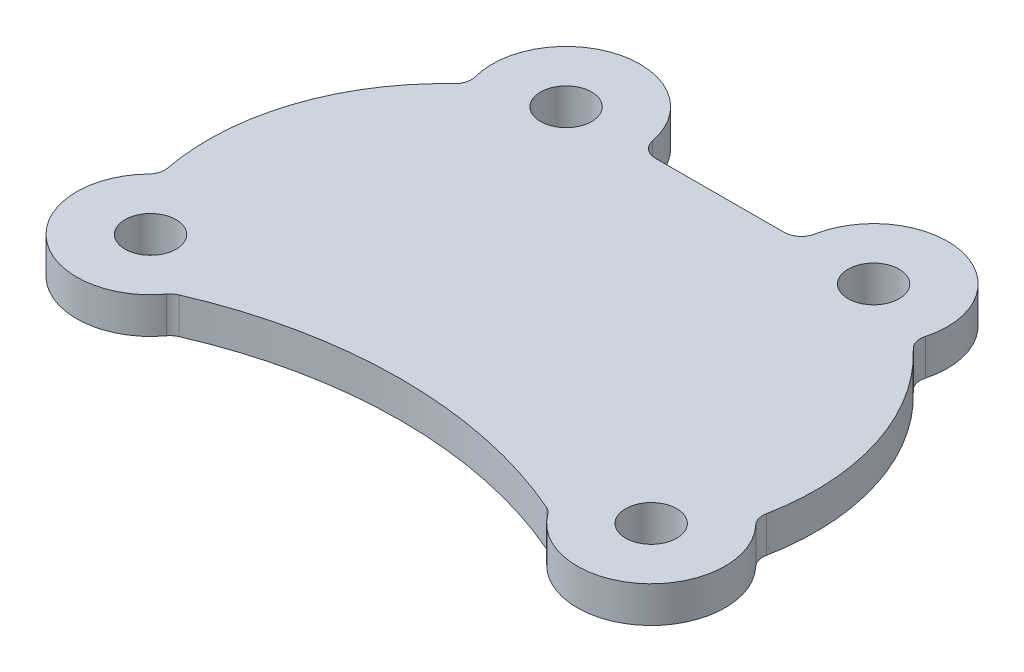
ISO-10303-21;
HEADER;
FILE_DESCRIPTION(('STEP AP214'),'2;1');
FILE_NAME('part.step','',(''),(''),'','','');
FILE_SCHEMA(('AUTOMOTIVE_DESIGN { 1 0 10303 214 1 1 1 1 }'));
ENDSEC;
DATA;
#1=APPLICATION_CONTEXT('core data for automotive mechanical design processes');
#2=APPLICATION_PROTOCOL_DEFINITION('international standard','automotive_design',2000,#1);
#3=PRODUCT_CONTEXT('',#1,'mechanical');
#4=PRODUCT('Part','Part','',(#3));
#5=PRODUCT_RELATED_PRODUCT_CATEGORY('part','',(#4));
#6=PRODUCT_DEFINITION_FORMATION('','',#4);
#7=PRODUCT_DEFINITION_CONTEXT('part definition',#1,'design');
#8=PRODUCT_DEFINITION('design','',#6,#7);
#9=PRODUCT_DEFINITION_SHAPE('','',#8);
#10=(LENGTH_UNIT() NAMED_UNIT(*) SI_UNIT(.MILLI.,.METRE.));
#11=(NAMED_UNIT(*) PLANE_ANGLE_UNIT() SI_UNIT($,.RADIAN.));
#12=(NAMED_UNIT(*) SI_UNIT($,.STERADIAN.) SOLID_ANGLE_UNIT());
#13=UNCERTAINTY_MEASURE_WITH_UNIT(LENGTH_MEASURE(1.E-05),#10,'distance_accuracy_value','');
#14=(GEOMETRIC_REPRESENTATION_CONTEXT(3) GLOBAL_UNCERTAINTY_ASSIGNED_CONTEXT((#13)) GLOBAL_UNIT_ASSIGNED_CONTEXT((#10,
#11,#12)) REPRESENTATION_CONTEXT('',''));
#15=CARTESIAN_POINT('',(0.,0.,0.));
#16=DIRECTION('',(0.,0.,1.));
#17=DIRECTION('',(1.,0.,0.));
#18=AXIS2_PLACEMENT_3D('',#15,#16,#17);
#19=CARTESIAN_POINT('',(32.8061466226183,6.35,-58.9531036052104));
#20=DIRECTION('',(0.,-1.,0.));
#21=DIRECTION('',(0.,0.,-1.));
#22=AXIS2_PLACEMENT_3D('',#19,#20,#21);
#23=PLANE('',#22);
#24=CARTESIAN_POINT('',(0.,6.35,0.));
#25=DIRECTION('',(0.,1.,0.));
#26=DIRECTION('',(0.,0.,1.));
#27=AXIS2_PLACEMENT_3D('',#24,#25,#26);
#28=CIRCLE('',#27,4.5);
#29=CARTESIAN_POINT('',(0.,6.35,4.5));
#30=VERTEX_POINT('',#29);
#31=EDGE_CURVE('E374',#30,#30,#28,.T.);
#32=ORIENTED_EDGE('',*,*,#31,.F.);
#33=EDGE_LOOP('',(#32));
#34=FACE_BOUND('',#33,.T.);
#35=CARTESIAN_POINT('',(17.0909373326016,6.35,-55.9477422340981));
#36=DIRECTION('',(0.,1.,0.));
#37=DIRECTION('',(0.,0.,1.));
#38=AXIS2_PLACEMENT_3D('',#35,#36,#37);
#39=CIRCLE('',#38,4.5);
#40=CARTESIAN_POINT('',(17.0909373326016,6.35,-51.4477422340981));
#41=VERTEX_POINT('',#40);
#42=EDGE_CURVE('E160',#41,#41,#39,.T.);
#43=ORIENTED_EDGE('',*,*,#42,.F.);
#44=EDGE_LOOP('',(#43));
#45=FACE_BOUND('',#44,.T.);
#46=CARTESIAN_POINT('',(32.8061466226183,6.35,-58.9531036052104));
#47=DIRECTION('',(0.,-1.,0.));
#48=DIRECTION('',(0.,0.,-1.));
#49=AXIS2_PLACEMENT_3D('',#46,#47,#48);
#50=CIRCLE('',#49,3.);
#51=CARTESIAN_POINT('',(32.8120638736978,6.35,-55.9531094408595));
#52=VERTEX_POINT('',#51);
#53=CARTESIAN_POINT('',(29.8595448807401,6.35,-58.3895983481269));
#54=VERTEX_POINT('',#53);
#55=EDGE_CURVE('E194',#52,#54,#50,.T.);
#56=ORIENTED_EDGE('',*,*,#55,.T.);
#57=CARTESIAN_POINT('',(17.0909373326016,6.35,-55.9477422340981));
#58=DIRECTION('',(0.,1.,0.));
#59=DIRECTION('',(0.,0.,1.));
#60=AXIS2_PLACEMENT_3D('',#57,#58,#59);
#61=CIRCLE('',#60,13.);
#62=CARTESIAN_POINT('',(4.54245769860197,6.35,-52.5513236975958));
#63=VERTEX_POINT('',#62);
#64=EDGE_CURVE('E155',#54,#63,#61,.T.);
#65=ORIENTED_EDGE('',*,*,#64,.T.);
#66=CARTESIAN_POINT('',(1.64665470614052,6.35,-51.7675348045568));
#67=DIRECTION('',(0.,-1.,0.));
#68=DIRECTION('',(0.,0.,1.));
#69=AXIS2_PLACEMENT_3D('',#66,#67,#68);
#70=CIRCLE('',#69,3.);
#71=CARTESIAN_POINT('',(3.70044759841328,6.35,-49.5807712700954));
#72=VERTEX_POINT('',#71);
#73=EDGE_CURVE('E197',#63,#72,#70,.T.);
#74=ORIENTED_EDGE('',*,*,#73,.T.);
#75=CARTESIAN_POINT('',(32.0193397833499,6.35,-19.4284024507483));
#76=DIRECTION('',(0.,1.,0.));
#77=DIRECTION('',(0.,0.,1.));
#78=AXIS2_PLACEMENT_3D('',#75,#76,#77);
#79=CIRCLE('',#78,41.3657466994131);
#80=CARTESIAN_POINT('',(-8.60571551005477,6.35,-11.6354644676884));
#81=VERTEX_POINT('',#80);
#82=EDGE_CURVE('E199',#72,#81,#79,.T.);
#83=ORIENTED_EDGE('',*,*,#82,.T.);
#84=CARTESIAN_POINT('',(-11.551997775085,6.35,-11.0702912068487));
#85=DIRECTION('',(0.,-1.,0.));
#86=DIRECTION('',(0.,0.,1.));
#87=AXIS2_PLACEMENT_3D('',#84,#85,#86);
#88=CIRCLE('',#87,3.);
#89=CARTESIAN_POINT('',(-9.38599819225658,6.35,-8.99461160556453));
#90=VERTEX_POINT('',#89);
#91=EDGE_CURVE('E201',#81,#90,#88,.T.);
#92=ORIENTED_EDGE('',*,*,#91,.T.);
#93=CARTESIAN_POINT('',(0.,6.35,0.));
#94=DIRECTION('',(0.,1.,0.));
#95=DIRECTION('',(0.,0.,1.));
#96=AXIS2_PLACEMENT_3D('',#93,#94,#95);
#97=CIRCLE('',#96,13.);
#98=CARTESIAN_POINT('',(10.4755168613593,6.35,7.69828204779337));
#99=VERTEX_POINT('',#98);
#100=EDGE_CURVE('E203',#90,#99,#97,.T.);
#101=ORIENTED_EDGE('',*,*,#100,.T.);
#102=CARTESIAN_POINT('',(12.8929438293653,6.35,9.47480867420723));
#103=DIRECTION('',(0.,-1.,0.));
#104=DIRECTION('',(0.,0.,1.));
#105=AXIS2_PLACEMENT_3D('',#102,#103,#104);
#106=CIRCLE('',#105,3.);
#107=CARTESIAN_POINT('',(11.6959283477128,6.35,6.72396263404351));
#108=VERTEX_POINT('',#107);
#109=EDGE_CURVE('E205',#99,#108,#106,.T.);
#110=ORIENTED_EDGE('',*,*,#109,.T.);
#111=CARTESIAN_POINT('',(44.,6.35,80.9615384615385));
#112=DIRECTION('',(0.,-1.,0.));
#113=DIRECTION('',(0.,0.,-1.));
#114=AXIS2_PLACEMENT_3D('',#111,#112,#113);
#115=CIRCLE('',#114,80.9615384615385);
#116=CARTESIAN_POINT('',(76.3040716522872,6.35,6.72396263404349));
#117=VERTEX_POINT('',#116);
#118=EDGE_CURVE('E207',#108,#117,#115,.T.);
#119=ORIENTED_EDGE('',*,*,#118,.T.);
#120=CARTESIAN_POINT('',(75.1070561706347,6.35,9.4748086742072));
#121=DIRECTION('',(0.,-1.,0.));
#122=DIRECTION('',(0.,0.,1.));
#123=AXIS2_PLACEMENT_3D('',#120,#121,#122);
#124=CIRCLE('',#123,3.);
#125=CARTESIAN_POINT('',(77.5244831386407,6.35,7.69828204779334));
#126=VERTEX_POINT('',#125);
#127=EDGE_CURVE('E209',#117,#126,#124,.T.);
#128=ORIENTED_EDGE('',*,*,#127,.T.);
#129=CARTESIAN_POINT('',(88.,6.35,0.));
#130=DIRECTION('',(0.,1.,0.));
#131=DIRECTION('',(0.,0.,1.));
#132=AXIS2_PLACEMENT_3D('',#129,#130,#131);
#133=CIRCLE('',#132,13.);
#134=CARTESIAN_POINT('',(97.4132599535078,6.35,-8.96607701548936));
#135=VERTEX_POINT('',#134);
#136=EDGE_CURVE('E211',#126,#135,#133,.T.);
#137=ORIENTED_EDGE('',*,*,#136,.T.);
#138=CARTESIAN_POINT('',(99.5855507120096,6.35,-11.0351717113715));
#139=DIRECTION('',(0.,-1.,0.));
#140=DIRECTION('',(0.,0.,1.));
#141=AXIS2_PLACEMENT_3D('',#138,#139,#140);
#142=CIRCLE('',#141,3.);
#143=CARTESIAN_POINT('',(96.641280567555,6.35,-11.610735188734));
#144=VERTEX_POINT('',#143);
#145=EDGE_CURVE('E213',#135,#144,#142,.T.);
#146=ORIENTED_EDGE('',*,*,#145,.T.);
#147=CARTESIAN_POINT('',(56.0439695641714,6.35,-19.5469395267377));
#148=DIRECTION('',(0.,1.,0.));
#149=DIRECTION('',(0.,0.,-1.));
#150=AXIS2_PLACEMENT_3D('',#147,#148,#149);
#151=CIRCLE('',#150,41.365746699413);
#152=CARTESIAN_POINT('',(84.4636142605688,6.35,-49.6043644884761));
#153=VERTEX_POINT('',#152);
#154=EDGE_CURVE('E215',#144,#153,#151,.T.);
#155=ORIENTED_EDGE('',*,*,#154,.T.);
#156=CARTESIAN_POINT('',(86.5247141050544,6.35,-51.7842423362146));
#157=DIRECTION('',(0.,-1.,0.));
#158=DIRECTION('',(0.,0.,1.));
#159=AXIS2_PLACEMENT_3D('',#156,#157,#158);
#160=CIRCLE('',#159,3.);
#161=CARTESIAN_POINT('',(83.6308756649022,6.35,-52.5752537661555));
#162=VERTEX_POINT('',#161);
#163=EDGE_CURVE('E217',#153,#162,#160,.T.);
#164=ORIENTED_EDGE('',*,*,#163,.T.);
#165=CARTESIAN_POINT('',(71.0909090909091,6.35,-56.0029699625663));
#166=DIRECTION('',(0.,1.,0.));
#167=DIRECTION('',(0.,0.,1.));
#168=AXIS2_PLACEMENT_3D('',#165,#166,#167);
#169=CIRCLE('',#168,13.);
#170=CARTESIAN_POINT('',(58.3206396875463,6.35,-58.4361200536078));
#171=VERTEX_POINT('',#170);
#172=EDGE_CURVE('E219',#162,#171,#169,.T.);
#173=ORIENTED_EDGE('',*,*,#172,.T.);
#174=CARTESIAN_POINT('',(55.3736544406164,6.35,-58.9976162284635));
#175=DIRECTION('',(0.,-1.,0.));
#176=DIRECTION('',(0.,0.,1.));
#177=AXIS2_PLACEMENT_3D('',#174,#175,#176);
#178=CIRCLE('',#177,3.);
#179=CARTESIAN_POINT('',(55.3795716916959,6.35,-55.9976220641126));
#180=VERTEX_POINT('',#179);
#181=EDGE_CURVE('E48',#171,#180,#178,.T.);
#182=ORIENTED_EDGE('',*,*,#181,.T.);
#183=DIRECTION('',(-0.999998054783645,0.,0.00197241702652385));
#184=VECTOR('',#183,1.);
#185=CARTESIAN_POINT('',(32.8120638736978,6.35,-55.9531094408595));
#186=LINE('',#185,#184);
#187=EDGE_CURVE('E43',#180,#52,#186,.T.);
#188=ORIENTED_EDGE('',*,*,#187,.T.);
#189=EDGE_LOOP('',(#56,#65,#74,#83,#92,#101,#110,#119,#128,#137,#146,#155,#164,#173,#182,#188));
#190=FACE_BOUND('',#189,.T.);
#191=CARTESIAN_POINT('',(71.0909090909091,6.35,-56.0029699625663));
#192=DIRECTION('',(0.,1.,0.));
#193=DIRECTION('',(0.,0.,1.));
#194=AXIS2_PLACEMENT_3D('',#191,#192,#193);
#195=CIRCLE('',#194,4.50000000000001);
#196=CARTESIAN_POINT('',(71.0909090909091,6.35,-51.5029699625663));
#197=VERTEX_POINT('',#196);
#198=EDGE_CURVE('E380',#197,#197,#195,.T.);
#199=ORIENTED_EDGE('',*,*,#198,.F.);
#200=EDGE_LOOP('',(#199));
#201=FACE_BOUND('',#200,.T.);
#202=CARTESIAN_POINT('',(88.,6.35,0.));
#203=DIRECTION('',(0.,1.,0.));
#204=DIRECTION('',(0.,0.,1.));
#205=AXIS2_PLACEMENT_3D('',#202,#203,#204);
#206=CIRCLE('',#205,4.5);
#207=CARTESIAN_POINT('',(88.,6.35,4.5));
#208=VERTEX_POINT('',#207);
#209=EDGE_CURVE('E363',#208,#208,#206,.T.);
#210=ORIENTED_EDGE('',*,*,#209,.F.);
#211=EDGE_LOOP('',(#210));
#212=FACE_BOUND('',#211,.T.);
#213=ADVANCED_FACE('F28',(#34,#45,#190,#201,#212),#23,.F.);
#214=CARTESIAN_POINT('',(32.8061466226183,0.,-58.9531036052104));
#215=DIRECTION('',(0.,-1.,0.));
#216=DIRECTION('',(0.,0.,-1.));
#217=AXIS2_PLACEMENT_3D('',#214,#215,#216);
#218=PLANE('',#217);
#219=CARTESIAN_POINT('',(0.,0.,0.));
#220=DIRECTION('',(0.,1.,0.));
#221=DIRECTION('',(0.,0.,1.));
#222=AXIS2_PLACEMENT_3D('',#219,#220,#221);
#223=CIRCLE('',#222,4.5);
#224=CARTESIAN_POINT('',(0.,0.,4.5));
#225=VERTEX_POINT('',#224);
#226=EDGE_CURVE('E369',#225,#225,#223,.T.);
#227=ORIENTED_EDGE('',*,*,#226,.T.);
#228=EDGE_LOOP('',(#227));
#229=FACE_BOUND('',#228,.T.);
#230=CARTESIAN_POINT('',(17.0909373326016,0.,-55.9477422340981));
#231=DIRECTION('',(0.,1.,0.));
#232=DIRECTION('',(0.,0.,1.));
#233=AXIS2_PLACEMENT_3D('',#230,#231,#232);
#234=CIRCLE('',#233,4.5);
#235=CARTESIAN_POINT('',(17.0909373326016,0.,-51.4477422340981));
#236=VERTEX_POINT('',#235);
#237=EDGE_CURVE('E163',#236,#236,#234,.T.);
#238=ORIENTED_EDGE('',*,*,#237,.T.);
#239=EDGE_LOOP('',(#238));
#240=FACE_BOUND('',#239,.T.);
#241=CARTESIAN_POINT('',(32.8061466226183,0.,-58.9531036052104));
#242=DIRECTION('',(0.,-1.,0.));
#243=DIRECTION('',(0.,0.,-1.));
#244=AXIS2_PLACEMENT_3D('',#241,#242,#243);
#245=CIRCLE('',#244,3.);
#246=CARTESIAN_POINT('',(32.8120638736978,0.,-55.9531094408595));
#247=VERTEX_POINT('',#246);
#248=CARTESIAN_POINT('',(29.8595448807401,0.,-58.3895983481269));
#249=VERTEX_POINT('',#248);
#250=EDGE_CURVE('E146',#247,#249,#245,.T.);
#251=ORIENTED_EDGE('',*,*,#250,.F.);
#252=DIRECTION('',(-0.999998054783645,0.,0.00197241702652385));
#253=VECTOR('',#252,1.);
#254=CARTESIAN_POINT('',(32.8120638736978,0.,-55.9531094408595));
#255=LINE('',#254,#253);
#256=CARTESIAN_POINT('',(55.3795716916959,0.,-55.9976220641126));
#257=VERTEX_POINT('',#256);
#258=EDGE_CURVE('E192',#257,#247,#255,.T.);
#259=ORIENTED_EDGE('',*,*,#258,.F.);
#260=CARTESIAN_POINT('',(55.3736544406164,0.,-58.9976162284635));
#261=DIRECTION('',(0.,-1.,0.));
#262=DIRECTION('',(0.,0.,1.));
#263=AXIS2_PLACEMENT_3D('',#260,#261,#262);
#264=CIRCLE('',#263,3.);
#265=CARTESIAN_POINT('',(58.3206396875463,0.,-58.4361200536078));
#266=VERTEX_POINT('',#265);
#267=EDGE_CURVE('E190',#266,#257,#264,.T.);
#268=ORIENTED_EDGE('',*,*,#267,.F.);
#269=CARTESIAN_POINT('',(71.0909090909091,0.,-56.0029699625663));
#270=DIRECTION('',(0.,1.,0.));
#271=DIRECTION('',(0.,0.,1.));
#272=AXIS2_PLACEMENT_3D('',#269,#270,#271);
#273=CIRCLE('',#272,13.);
#274=CARTESIAN_POINT('',(83.6308756649022,0.,-52.5752537661555));
#275=VERTEX_POINT('',#274);
#276=EDGE_CURVE('E188',#275,#266,#273,.T.);
#277=ORIENTED_EDGE('',*,*,#276,.F.);
#278=CARTESIAN_POINT('',(86.5247141050544,0.,-51.7842423362146));
#279=DIRECTION('',(0.,-1.,0.));
#280=DIRECTION('',(0.,0.,1.));
#281=AXIS2_PLACEMENT_3D('',#278,#279,#280);
#282=CIRCLE('',#281,3.);
#283=CARTESIAN_POINT('',(84.4636142605688,0.,-49.6043644884761));
#284=VERTEX_POINT('',#283);
#285=EDGE_CURVE('E186',#284,#275,#282,.T.);
#286=ORIENTED_EDGE('',*,*,#285,.F.);
#287=CARTESIAN_POINT('',(56.0439695641714,0.,-19.5469395267377));
#288=DIRECTION('',(0.,1.,0.));
#289=DIRECTION('',(0.,0.,-1.));
#290=AXIS2_PLACEMENT_3D('',#287,#288,#289);
#291=CIRCLE('',#290,41.365746699413);
#292=CARTESIAN_POINT('',(96.641280567555,0.,-11.610735188734));
#293=VERTEX_POINT('',#292);
#294=EDGE_CURVE('E184',#293,#284,#291,.T.);
#295=ORIENTED_EDGE('',*,*,#294,.F.);
#296=CARTESIAN_POINT('',(99.5855507120096,0.,-11.0351717113715));
#297=DIRECTION('',(0.,-1.,0.));
#298=DIRECTION('',(0.,0.,1.));
#299=AXIS2_PLACEMENT_3D('',#296,#297,#298);
#300=CIRCLE('',#299,3.);
#301=CARTESIAN_POINT('',(97.4132599535078,0.,-8.96607701548936));
#302=VERTEX_POINT('',#301);
#303=EDGE_CURVE('E182',#302,#293,#300,.T.);
#304=ORIENTED_EDGE('',*,*,#303,.F.);
#305=CARTESIAN_POINT('',(88.,0.,0.));
#306=DIRECTION('',(0.,1.,0.));
#307=DIRECTION('',(0.,0.,1.));
#308=AXIS2_PLACEMENT_3D('',#305,#306,#307);
#309=CIRCLE('',#308,13.);
#310=CARTESIAN_POINT('',(77.5244831386407,0.,7.69828204779334));
#311=VERTEX_POINT('',#310);
#312=EDGE_CURVE('E180',#311,#302,#309,.T.);
#313=ORIENTED_EDGE('',*,*,#312,.F.);
#314=CARTESIAN_POINT('',(75.1070561706347,0.,9.4748086742072));
#315=DIRECTION('',(0.,-1.,0.));
#316=DIRECTION('',(0.,0.,1.));
#317=AXIS2_PLACEMENT_3D('',#314,#315,#316);
#318=CIRCLE('',#317,3.);
#319=CARTESIAN_POINT('',(76.3040716522872,0.,6.72396263404349));
#320=VERTEX_POINT('',#319);
#321=EDGE_CURVE('E178',#320,#311,#318,.T.);
#322=ORIENTED_EDGE('',*,*,#321,.F.);
#323=CARTESIAN_POINT('',(44.,0.,80.9615384615385));
#324=DIRECTION('',(0.,-1.,0.));
#325=DIRECTION('',(0.,0.,-1.));
#326=AXIS2_PLACEMENT_3D('',#323,#324,#325);
#327=CIRCLE('',#326,80.9615384615385);
#328=CARTESIAN_POINT('',(11.6959283477128,0.,6.72396263404351));
#329=VERTEX_POINT('',#328);
#330=EDGE_CURVE('E176',#329,#320,#327,.T.);
#331=ORIENTED_EDGE('',*,*,#330,.F.);
#332=CARTESIAN_POINT('',(12.8929438293653,0.,9.47480867420723));
#333=DIRECTION('',(0.,-1.,0.));
#334=DIRECTION('',(0.,0.,1.));
#335=AXIS2_PLACEMENT_3D('',#332,#333,#334);
#336=CIRCLE('',#335,3.);
#337=CARTESIAN_POINT('',(10.4755168613593,0.,7.69828204779337));
#338=VERTEX_POINT('',#337);
#339=EDGE_CURVE('E174',#338,#329,#336,.T.);
#340=ORIENTED_EDGE('',*,*,#339,.F.);
#341=CARTESIAN_POINT('',(0.,0.,0.));
#342=DIRECTION('',(0.,1.,0.));
#343=DIRECTION('',(0.,0.,1.));
#344=AXIS2_PLACEMENT_3D('',#341,#342,#343);
#345=CIRCLE('',#344,13.);
#346=CARTESIAN_POINT('',(-9.38599819225658,0.,-8.99461160556453));
#347=VERTEX_POINT('',#346);
#348=EDGE_CURVE('E172',#347,#338,#345,.T.);
#349=ORIENTED_EDGE('',*,*,#348,.F.);
#350=CARTESIAN_POINT('',(-11.551997775085,0.,-11.0702912068487));
#351=DIRECTION('',(0.,-1.,0.));
#352=DIRECTION('',(0.,0.,1.));
#353=AXIS2_PLACEMENT_3D('',#350,#351,#352);
#354=CIRCLE('',#353,3.);
#355=CARTESIAN_POINT('',(-8.60571551005477,0.,-11.6354644676884));
#356=VERTEX_POINT('',#355);
#357=EDGE_CURVE('E170',#356,#347,#354,.T.);
#358=ORIENTED_EDGE('',*,*,#357,.F.);
#359=CARTESIAN_POINT('',(32.0193397833499,0.,-19.4284024507483));
#360=DIRECTION('',(0.,1.,0.));
#361=DIRECTION('',(0.,0.,1.));
#362=AXIS2_PLACEMENT_3D('',#359,#360,#361);
#363=CIRCLE('',#362,41.3657466994131);
#364=CARTESIAN_POINT('',(3.70044759841328,0.,-49.5807712700954));
#365=VERTEX_POINT('',#364);
#366=EDGE_CURVE('E168',#365,#356,#363,.T.);
#367=ORIENTED_EDGE('',*,*,#366,.F.);
#368=CARTESIAN_POINT('',(1.64665470614052,0.,-51.7675348045568));
#369=DIRECTION('',(0.,-1.,0.));
#370=DIRECTION('',(0.,0.,1.));
#371=AXIS2_PLACEMENT_3D('',#368,#369,#370);
#372=CIRCLE('',#371,3.);
#373=CARTESIAN_POINT('',(4.54245769860197,0.,-52.5513236975958));
#374=VERTEX_POINT('',#373);
#375=EDGE_CURVE('E148',#374,#365,#372,.T.);
#376=ORIENTED_EDGE('',*,*,#375,.F.);
#377=CARTESIAN_POINT('',(17.0909373326016,0.,-55.9477422340981));
#378=DIRECTION('',(0.,1.,0.));
#379=DIRECTION('',(0.,0.,1.));
#380=AXIS2_PLACEMENT_3D('',#377,#378,#379);
#381=CIRCLE('',#380,13.);
#382=EDGE_CURVE('E141',#249,#374,#381,.T.);
#383=ORIENTED_EDGE('',*,*,#382,.F.);
#384=EDGE_LOOP('',(#251,#259,#268,#277,#286,#295,#304,#313,#322,#331,#340,#349,#358,#367,#376,#383));
#385=FACE_BOUND('',#384,.T.);
#386=CARTESIAN_POINT('',(71.0909090909091,0.,-56.0029699625663));
#387=DIRECTION('',(0.,1.,0.));
#388=DIRECTION('',(0.,0.,1.));
#389=AXIS2_PLACEMENT_3D('',#386,#387,#388);
#390=CIRCLE('',#389,4.50000000000001);
#391=CARTESIAN_POINT('',(71.0909090909091,0.,-51.5029699625663));
#392=VERTEX_POINT('',#391);
#393=EDGE_CURVE('E377',#392,#392,#390,.T.);
#394=ORIENTED_EDGE('',*,*,#393,.T.);
#395=EDGE_LOOP('',(#394));
#396=FACE_BOUND('',#395,.T.);
#397=CARTESIAN_POINT('',(88.,0.,0.));
#398=DIRECTION('',(0.,1.,0.));
#399=DIRECTION('',(0.,0.,1.));
#400=AXIS2_PLACEMENT_3D('',#397,#398,#399);
#401=CIRCLE('',#400,4.5);
#402=CARTESIAN_POINT('',(88.,0.,4.5));
#403=VERTEX_POINT('',#402);
#404=EDGE_CURVE('E366',#403,#403,#401,.T.);
#405=ORIENTED_EDGE('',*,*,#404,.T.);
#406=EDGE_LOOP('',(#405));
#407=FACE_BOUND('',#406,.T.);
#408=ADVANCED_FACE('F142',(#229,#240,#385,#396,#407),#218,.T.);
#409=CARTESIAN_POINT('',(32.8061466226183,6.35,-58.9531036052104));
#410=DIRECTION('',(0.,-1.,0.));
#411=DIRECTION('',(0.,0.,-1.));
#412=AXIS2_PLACEMENT_3D('',#409,#410,#411);
#413=CYLINDRICAL_SURFACE('',#412,3.);
#414=ORIENTED_EDGE('',*,*,#250,.T.);
#415=DIRECTION('',(0.,-1.,0.));
#416=VECTOR('',#415,1.);
#417=CARTESIAN_POINT('',(29.8595448807401,6.35,-58.3895983481269));
#418=LINE('',#417,#416);
#419=EDGE_CURVE('E11',#54,#249,#418,.T.);
#420=ORIENTED_EDGE('',*,*,#419,.F.);
#421=ORIENTED_EDGE('',*,*,#55,.F.);
#422=DIRECTION('',(0.,-1.,0.));
#423=VECTOR('',#422,1.);
#424=CARTESIAN_POINT('',(32.8120638736978,6.35,-55.9531094408595));
#425=LINE('',#424,#423);
#426=EDGE_CURVE('E159',#52,#247,#425,.T.);
#427=ORIENTED_EDGE('',*,*,#426,.T.);
#428=EDGE_LOOP('',(#414,#420,#421,#427));
#429=FACE_BOUND('',#428,.T.);
#430=ADVANCED_FACE('F30',(#429),#413,.F.);
#431=CARTESIAN_POINT('',(17.0909373326016,6.35,-55.9477422340981));
#432=DIRECTION('',(0.,-1.,0.));
#433=DIRECTION('',(0.,0.,-1.));
#434=AXIS2_PLACEMENT_3D('',#431,#432,#433);
#435=CYLINDRICAL_SURFACE('',#434,13.);
#436=ORIENTED_EDGE('',*,*,#382,.T.);
#437=DIRECTION('',(0.,-1.,0.));
#438=VECTOR('',#437,1.);
#439=CARTESIAN_POINT('',(4.54245769860197,6.35,-52.5513236975958));
#440=LINE('',#439,#438);
#441=EDGE_CURVE('E36',#63,#374,#440,.T.);
#442=ORIENTED_EDGE('',*,*,#441,.F.);
#443=ORIENTED_EDGE('',*,*,#64,.F.);
#444=ORIENTED_EDGE('',*,*,#419,.T.);
#445=EDGE_LOOP('',(#436,#442,#443,#444));
#446=FACE_BOUND('',#445,.T.);
#447=ADVANCED_FACE('F154',(#446),#435,.T.);
#448=CARTESIAN_POINT('',(1.64665470614052,6.35,-51.7675348045568));
#449=DIRECTION('',(0.,-1.,0.));
#450=DIRECTION('',(0.,0.,-1.));
#451=AXIS2_PLACEMENT_3D('',#448,#449,#450);
#452=CYLINDRICAL_SURFACE('',#451,3.);
#453=ORIENTED_EDGE('',*,*,#375,.T.);
#454=DIRECTION('',(0.,-1.,0.));
#455=VECTOR('',#454,1.);
#456=CARTESIAN_POINT('',(3.70044759841328,6.35,-49.5807712700954));
#457=LINE('',#456,#455);
#458=EDGE_CURVE('E260',#72,#365,#457,.T.);
#459=ORIENTED_EDGE('',*,*,#458,.F.);
#460=ORIENTED_EDGE('',*,*,#73,.F.);
#461=ORIENTED_EDGE('',*,*,#441,.T.);
#462=EDGE_LOOP('',(#453,#459,#460,#461));
#463=FACE_BOUND('',#462,.T.);
#464=ADVANCED_FACE('F264',(#463),#452,.F.);
#465=CARTESIAN_POINT('',(32.0193397833499,6.35,-19.4284024507483));
#466=DIRECTION('',(0.,-1.,0.));
#467=DIRECTION('',(0.,0.,-1.));
#468=AXIS2_PLACEMENT_3D('',#465,#466,#467);
#469=CYLINDRICAL_SURFACE('',#468,41.3657466994131);
#470=ORIENTED_EDGE('',*,*,#366,.T.);
#471=DIRECTION('',(0.,-1.,0.));
#472=VECTOR('',#471,1.);
#473=CARTESIAN_POINT('',(-8.60571551005477,6.35,-11.6354644676884));
#474=LINE('',#473,#472);
#475=EDGE_CURVE('E257',#81,#356,#474,.T.);
#476=ORIENTED_EDGE('',*,*,#475,.F.);
#477=ORIENTED_EDGE('',*,*,#82,.F.);
#478=ORIENTED_EDGE('',*,*,#458,.T.);
#479=EDGE_LOOP('',(#470,#476,#477,#478));
#480=FACE_BOUND('',#479,.T.);
#481=ADVANCED_FACE('F272',(#480),#469,.T.);
#482=CARTESIAN_POINT('',(-11.551997775085,6.35,-11.0702912068487));
#483=DIRECTION('',(0.,-1.,0.));
#484=DIRECTION('',(0.,0.,-1.));
#485=AXIS2_PLACEMENT_3D('',#482,#483,#484);
#486=CYLINDRICAL_SURFACE('',#485,3.);
#487=ORIENTED_EDGE('',*,*,#357,.T.);
#488=DIRECTION('',(0.,-1.,0.));
#489=VECTOR('',#488,1.);
#490=CARTESIAN_POINT('',(-9.38599819225658,6.35,-8.99461160556453));
#491=LINE('',#490,#489);
#492=EDGE_CURVE('E254',#90,#347,#491,.T.);
#493=ORIENTED_EDGE('',*,*,#492,.F.);
#494=ORIENTED_EDGE('',*,*,#91,.F.);
#495=ORIENTED_EDGE('',*,*,#475,.T.);
#496=EDGE_LOOP('',(#487,#493,#494,#495));
#497=FACE_BOUND('',#496,.T.);
#498=ADVANCED_FACE('F275',(#497),#486,.F.);
#499=CARTESIAN_POINT('',(0.,6.35,0.));
#500=DIRECTION('',(0.,-1.,0.));
#501=DIRECTION('',(0.,0.,-1.));
#502=AXIS2_PLACEMENT_3D('',#499,#500,#501);
#503=CYLINDRICAL_SURFACE('',#502,13.);
#504=ORIENTED_EDGE('',*,*,#348,.T.);
#505=DIRECTION('',(0.,-1.,0.));
#506=VECTOR('',#505,1.);
#507=CARTESIAN_POINT('',(10.4755168613593,6.35,7.69828204779337));
#508=LINE('',#507,#506);
#509=EDGE_CURVE('E251',#99,#338,#508,.T.);
#510=ORIENTED_EDGE('',*,*,#509,.F.);
#511=ORIENTED_EDGE('',*,*,#100,.F.);
#512=ORIENTED_EDGE('',*,*,#492,.T.);
#513=EDGE_LOOP('',(#504,#510,#511,#512));
#514=FACE_BOUND('',#513,.T.);
#515=ADVANCED_FACE('F280',(#514),#503,.T.);
#516=CARTESIAN_POINT('',(12.8929438293653,6.35,9.47480867420723));
#517=DIRECTION('',(0.,-1.,0.));
#518=DIRECTION('',(0.,0.,-1.));
#519=AXIS2_PLACEMENT_3D('',#516,#517,#518);
#520=CYLINDRICAL_SURFACE('',#519,3.);
#521=ORIENTED_EDGE('',*,*,#339,.T.);
#522=DIRECTION('',(0.,-1.,0.));
#523=VECTOR('',#522,1.);
#524=CARTESIAN_POINT('',(11.6959283477128,6.35,6.72396263404351));
#525=LINE('',#524,#523);
#526=EDGE_CURVE('E248',#108,#329,#525,.T.);
#527=ORIENTED_EDGE('',*,*,#526,.F.);
#528=ORIENTED_EDGE('',*,*,#109,.F.);
#529=ORIENTED_EDGE('',*,*,#509,.T.);
#530=EDGE_LOOP('',(#521,#527,#528,#529));
#531=FACE_BOUND('',#530,.T.);
#532=ADVANCED_FACE('F286',(#531),#520,.F.);
#533=CARTESIAN_POINT('',(44.,6.35,80.9615384615385));
#534=DIRECTION('',(0.,-1.,0.));
#535=DIRECTION('',(0.,0.,-1.));
#536=AXIS2_PLACEMENT_3D('',#533,#534,#535);
#537=CYLINDRICAL_SURFACE('',#536,80.9615384615385);
#538=ORIENTED_EDGE('',*,*,#330,.T.);
#539=DIRECTION('',(0.,-1.,0.));
#540=VECTOR('',#539,1.);
#541=CARTESIAN_POINT('',(76.3040716522872,6.35,6.72396263404349));
#542=LINE('',#541,#540);
#543=EDGE_CURVE('E245',#117,#320,#542,.T.);
#544=ORIENTED_EDGE('',*,*,#543,.F.);
#545=ORIENTED_EDGE('',*,*,#118,.F.);
#546=ORIENTED_EDGE('',*,*,#526,.T.);
#547=EDGE_LOOP('',(#538,#544,#545,#546));
#548=FACE_BOUND('',#547,.T.);
#549=ADVANCED_FACE('F290',(#548),#537,.F.);
#550=CARTESIAN_POINT('',(75.1070561706347,6.35,9.4748086742072));
#551=DIRECTION('',(0.,-1.,0.));
#552=DIRECTION('',(0.,0.,-1.));
#553=AXIS2_PLACEMENT_3D('',#550,#551,#552);
#554=CYLINDRICAL_SURFACE('',#553,3.);
#555=ORIENTED_EDGE('',*,*,#321,.T.);
#556=DIRECTION('',(0.,-1.,0.));
#557=VECTOR('',#556,1.);
#558=CARTESIAN_POINT('',(77.5244831386407,6.35,7.69828204779334));
#559=LINE('',#558,#557);
#560=EDGE_CURVE('E242',#126,#311,#559,.T.);
#561=ORIENTED_EDGE('',*,*,#560,.F.);
#562=ORIENTED_EDGE('',*,*,#127,.F.);
#563=ORIENTED_EDGE('',*,*,#543,.T.);
#564=EDGE_LOOP('',(#555,#561,#562,#563));
#565=FACE_BOUND('',#564,.T.);
#566=ADVANCED_FACE('F295',(#565),#554,.F.);
#567=CARTESIAN_POINT('',(88.,6.35,0.));
#568=DIRECTION('',(0.,-1.,0.));
#569=DIRECTION('',(0.,0.,-1.));
#570=AXIS2_PLACEMENT_3D('',#567,#568,#569);
#571=CYLINDRICAL_SURFACE('',#570,13.);
#572=ORIENTED_EDGE('',*,*,#312,.T.);
#573=DIRECTION('',(0.,-1.,0.));
#574=VECTOR('',#573,1.);
#575=CARTESIAN_POINT('',(97.4132599535078,6.35,-8.96607701548936));
#576=LINE('',#575,#574);
#577=EDGE_CURVE('E239',#135,#302,#576,.T.);
#578=ORIENTED_EDGE('',*,*,#577,.F.);
#579=ORIENTED_EDGE('',*,*,#136,.F.);
#580=ORIENTED_EDGE('',*,*,#560,.T.);
#581=EDGE_LOOP('',(#572,#578,#579,#580));
#582=FACE_BOUND('',#581,.T.);
#583=ADVANCED_FACE('F301',(#582),#571,.T.);
#584=CARTESIAN_POINT('',(99.5855507120096,6.35,-11.0351717113715));
#585=DIRECTION('',(0.,-1.,0.));
#586=DIRECTION('',(0.,0.,-1.));
#587=AXIS2_PLACEMENT_3D('',#584,#585,#586);
#588=CYLINDRICAL_SURFACE('',#587,3.);
#589=ORIENTED_EDGE('',*,*,#303,.T.);
#590=DIRECTION('',(0.,-1.,0.));
#591=VECTOR('',#590,1.);
#592=CARTESIAN_POINT('',(96.641280567555,6.35,-11.610735188734));
#593=LINE('',#592,#591);
#594=EDGE_CURVE('E236',#144,#293,#593,.T.);
#595=ORIENTED_EDGE('',*,*,#594,.F.);
#596=ORIENTED_EDGE('',*,*,#145,.F.);
#597=ORIENTED_EDGE('',*,*,#577,.T.);
#598=EDGE_LOOP('',(#589,#595,#596,#597));
#599=FACE_BOUND('',#598,.T.);
#600=ADVANCED_FACE('F305',(#599),#588,.F.);
#601=CARTESIAN_POINT('',(56.0439695641714,6.35,-19.5469395267377));
#602=DIRECTION('',(0.,-1.,0.));
#603=DIRECTION('',(0.,0.,-1.));
#604=AXIS2_PLACEMENT_3D('',#601,#602,#603);
#605=CYLINDRICAL_SURFACE('',#604,41.365746699413);
#606=ORIENTED_EDGE('',*,*,#294,.T.);
#607=DIRECTION('',(0.,-1.,0.));
#608=VECTOR('',#607,1.);
#609=CARTESIAN_POINT('',(84.4636142605688,6.35,-49.6043644884761));
#610=LINE('',#609,#608);
#611=EDGE_CURVE('E233',#153,#284,#610,.T.);
#612=ORIENTED_EDGE('',*,*,#611,.F.);
#613=ORIENTED_EDGE('',*,*,#154,.F.);
#614=ORIENTED_EDGE('',*,*,#594,.T.);
#615=EDGE_LOOP('',(#606,#612,#613,#614));
#616=FACE_BOUND('',#615,.T.);
#617=ADVANCED_FACE('F310',(#616),#605,.T.);
#618=CARTESIAN_POINT('',(86.5247141050544,6.35,-51.7842423362146));
#619=DIRECTION('',(0.,-1.,0.));
#620=DIRECTION('',(0.,0.,-1.));
#621=AXIS2_PLACEMENT_3D('',#618,#619,#620);
#622=CYLINDRICAL_SURFACE('',#621,3.);
#623=ORIENTED_EDGE('',*,*,#285,.T.);
#624=DIRECTION('',(0.,-1.,0.));
#625=VECTOR('',#624,1.);
#626=CARTESIAN_POINT('',(83.6308756649022,6.35,-52.5752537661555));
#627=LINE('',#626,#625);
#628=EDGE_CURVE('E230',#162,#275,#627,.T.);
#629=ORIENTED_EDGE('',*,*,#628,.F.);
#630=ORIENTED_EDGE('',*,*,#163,.F.);
#631=ORIENTED_EDGE('',*,*,#611,.T.);
#632=EDGE_LOOP('',(#623,#629,#630,#631));
#633=FACE_BOUND('',#632,.T.);
#634=ADVANCED_FACE('F316',(#633),#622,.F.);
#635=CARTESIAN_POINT('',(71.0909090909091,6.35,-56.0029699625663));
#636=DIRECTION('',(0.,-1.,0.));
#637=DIRECTION('',(0.,0.,-1.));
#638=AXIS2_PLACEMENT_3D('',#635,#636,#637);
#639=CYLINDRICAL_SURFACE('',#638,13.);
#640=ORIENTED_EDGE('',*,*,#276,.T.);
#641=DIRECTION('',(0.,-1.,0.));
#642=VECTOR('',#641,1.);
#643=CARTESIAN_POINT('',(58.3206396875463,6.35,-58.4361200536078));
#644=LINE('',#643,#642);
#645=EDGE_CURVE('E227',#171,#266,#644,.T.);
#646=ORIENTED_EDGE('',*,*,#645,.F.);
#647=ORIENTED_EDGE('',*,*,#172,.F.);
#648=ORIENTED_EDGE('',*,*,#628,.T.);
#649=EDGE_LOOP('',(#640,#646,#647,#648));
#650=FACE_BOUND('',#649,.T.);
#651=ADVANCED_FACE('F320',(#650),#639,.T.);
#652=CARTESIAN_POINT('',(55.3736544406164,6.35,-58.9976162284635));
#653=DIRECTION('',(0.,-1.,0.));
#654=DIRECTION('',(0.,0.,-1.));
#655=AXIS2_PLACEMENT_3D('',#652,#653,#654);
#656=CYLINDRICAL_SURFACE('',#655,3.);
#657=ORIENTED_EDGE('',*,*,#267,.T.);
#658=DIRECTION('',(0.,-1.,0.));
#659=VECTOR('',#658,1.);
#660=CARTESIAN_POINT('',(55.3795716916959,6.35,-55.9976220641126));
#661=LINE('',#660,#659);
#662=EDGE_CURVE('E224',#180,#257,#661,.T.);
#663=ORIENTED_EDGE('',*,*,#662,.F.);
#664=ORIENTED_EDGE('',*,*,#181,.F.);
#665=ORIENTED_EDGE('',*,*,#645,.T.);
#666=EDGE_LOOP('',(#657,#663,#664,#665));
#667=FACE_BOUND('',#666,.T.);
#668=ADVANCED_FACE('F323',(#667),#656,.F.);
#669=CARTESIAN_POINT('',(32.8120638736978,6.35,-55.9531094408595));
#670=DIRECTION('',(0.00197241702652385,0.,0.999998054783645));
#671=DIRECTION('',(0.999998054783645,0.,-0.00197241702652385));
#672=AXIS2_PLACEMENT_3D('',#669,#670,#671);
#673=PLANE('',#672);
#674=ORIENTED_EDGE('',*,*,#258,.T.);
#675=ORIENTED_EDGE('',*,*,#426,.F.);
#676=ORIENTED_EDGE('',*,*,#187,.F.);
#677=ORIENTED_EDGE('',*,*,#662,.T.);
#678=EDGE_LOOP('',(#674,#675,#676,#677));
#679=FACE_BOUND('',#678,.T.);
#680=ADVANCED_FACE('F325',(#679),#673,.F.);
#681=CARTESIAN_POINT('',(17.0909373326016,6.35,-55.9477422340981));
#682=DIRECTION('',(0.,-1.,0.));
#683=DIRECTION('',(0.,0.,-1.));
#684=AXIS2_PLACEMENT_3D('',#681,#682,#683);
#685=CYLINDRICAL_SURFACE('',#684,4.5);
#686=ORIENTED_EDGE('',*,*,#42,.T.);
#687=EDGE_LOOP('',(#686));
#688=FACE_BOUND('',#687,.T.);
#689=ORIENTED_EDGE('',*,*,#237,.F.);
#690=EDGE_LOOP('',(#689));
#691=FACE_BOUND('',#690,.T.);
#692=ADVANCED_FACE('F327',(#688,#691),#685,.F.);
#693=CARTESIAN_POINT('',(71.0909090909091,6.35,-56.0029699625663));
#694=DIRECTION('',(0.,-1.,0.));
#695=DIRECTION('',(0.,0.,-1.));
#696=AXIS2_PLACEMENT_3D('',#693,#694,#695);
#697=CYLINDRICAL_SURFACE('',#696,4.50000000000001);
#698=ORIENTED_EDGE('',*,*,#198,.T.);
#699=EDGE_LOOP('',(#698));
#700=FACE_BOUND('',#699,.T.);
#701=ORIENTED_EDGE('',*,*,#393,.F.);
#702=EDGE_LOOP('',(#701));
#703=FACE_BOUND('',#702,.T.);
#704=ADVANCED_FACE('F333',(#700,#703),#697,.F.);
#705=CARTESIAN_POINT('',(0.,6.35,0.));
#706=DIRECTION('',(0.,-1.,0.));
#707=DIRECTION('',(0.,0.,-1.));
#708=AXIS2_PLACEMENT_3D('',#705,#706,#707);
#709=CYLINDRICAL_SURFACE('',#708,4.5);
#710=ORIENTED_EDGE('',*,*,#31,.T.);
#711=EDGE_LOOP('',(#710));
#712=FACE_BOUND('',#711,.T.);
#713=ORIENTED_EDGE('',*,*,#226,.F.);
#714=EDGE_LOOP('',(#713));
#715=FACE_BOUND('',#714,.T.);
#716=ADVANCED_FACE('F350',(#712,#715),#709,.F.);
#717=CARTESIAN_POINT('',(88.,6.35,0.));
#718=DIRECTION('',(0.,-1.,0.));
#719=DIRECTION('',(0.,0.,-1.));
#720=AXIS2_PLACEMENT_3D('',#717,#718,#719);
#721=CYLINDRICAL_SURFACE('',#720,4.5);
#722=ORIENTED_EDGE('',*,*,#209,.T.);
#723=EDGE_LOOP('',(#722));
#724=FACE_BOUND('',#723,.T.);
#725=ORIENTED_EDGE('',*,*,#404,.F.);
#726=EDGE_LOOP('',(#725));
#727=FACE_BOUND('',#726,.T.);
#728=ADVANCED_FACE('F354',(#724,#727),#721,.F.);
#729=CLOSED_SHELL('',(#213,#408,#430,#447,#464,#481,#498,#515,#532,#549,#566,#583,#600,#617,
#634,#651,#668,#680,#692,#704,#716,#728));
#730=MANIFOLD_SOLID_BREP('B2',#729);
#731=ADVANCED_BREP_SHAPE_REPRESENTATION('',(#18,#730),#14);
#732=SHAPE_DEFINITION_REPRESENTATION(#9,#731);
ENDSEC;
END-ISO-10303-21;
